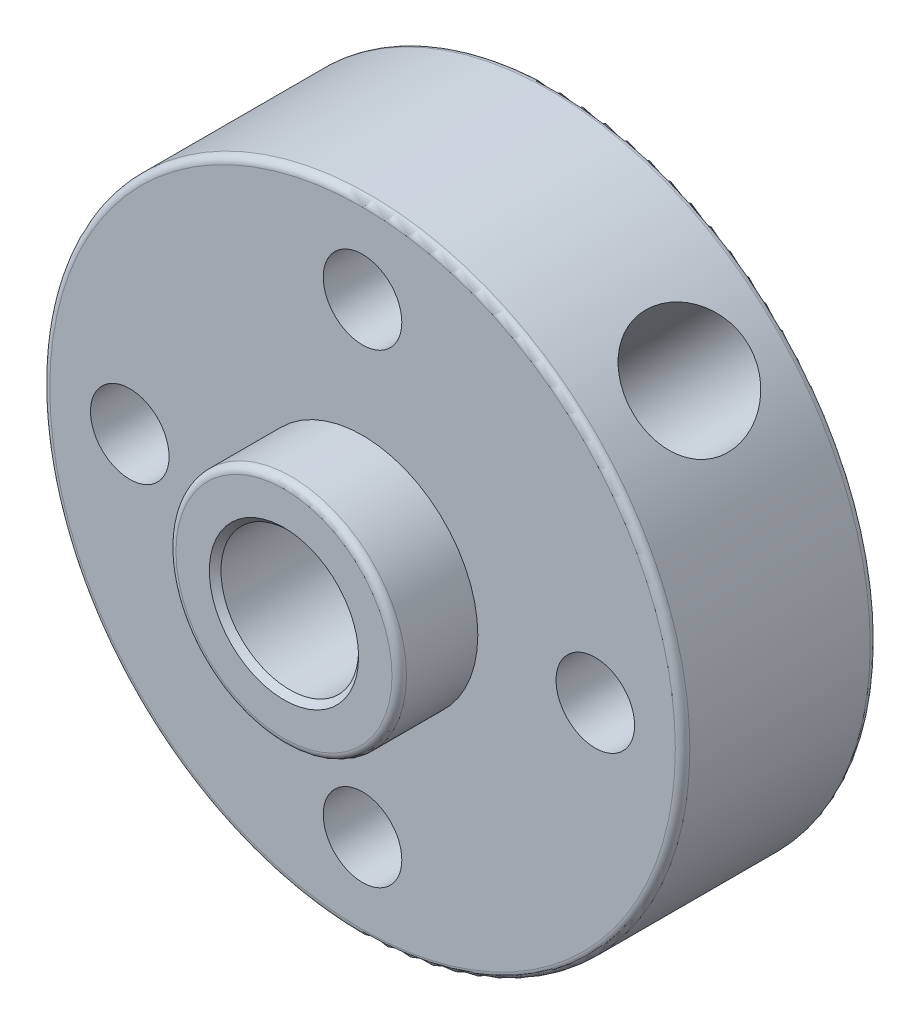
ISO-10303-21;
HEADER;
FILE_DESCRIPTION(('STEP AP214'),'2;1');
FILE_NAME('part.step','',(''),(''),'','','');
FILE_SCHEMA(('AUTOMOTIVE_DESIGN { 1 0 10303 214 1 1 1 1 }'));
ENDSEC;
DATA;
#1=APPLICATION_CONTEXT('core data for automotive mechanical design processes');
#2=APPLICATION_PROTOCOL_DEFINITION('international standard','automotive_design',2000,#1);
#3=PRODUCT_CONTEXT('',#1,'mechanical');
#4=PRODUCT('Part','Part','',(#3));
#5=PRODUCT_RELATED_PRODUCT_CATEGORY('part','',(#4));
#6=PRODUCT_DEFINITION_FORMATION('','',#4);
#7=PRODUCT_DEFINITION_CONTEXT('part definition',#1,'design');
#8=PRODUCT_DEFINITION('design','',#6,#7);
#9=PRODUCT_DEFINITION_SHAPE('','',#8);
#10=(LENGTH_UNIT() NAMED_UNIT(*) SI_UNIT(.MILLI.,.METRE.));
#11=(NAMED_UNIT(*) PLANE_ANGLE_UNIT() SI_UNIT($,.RADIAN.));
#12=(NAMED_UNIT(*) SI_UNIT($,.STERADIAN.) SOLID_ANGLE_UNIT());
#13=UNCERTAINTY_MEASURE_WITH_UNIT(LENGTH_MEASURE(1.E-05),#10,'distance_accuracy_value','');
#14=(GEOMETRIC_REPRESENTATION_CONTEXT(3) GLOBAL_UNCERTAINTY_ASSIGNED_CONTEXT((#13)) GLOBAL_UNIT_ASSIGNED_CONTEXT((#10,
#11,#12)) REPRESENTATION_CONTEXT('',''));
#15=CARTESIAN_POINT('',(0.,0.,0.));
#16=DIRECTION('',(0.,0.,1.));
#17=DIRECTION('',(1.,0.,0.));
#18=AXIS2_PLACEMENT_3D('',#15,#16,#17);
#19=CARTESIAN_POINT('',(0.,0.,0.));
#20=DIRECTION('',(0.,0.,1.));
#21=DIRECTION('',(1.,0.,0.));
#22=AXIS2_PLACEMENT_3D('',#19,#20,#21);
#23=PLANE('',#22);
#24=CARTESIAN_POINT('',(0.,0.,0.));
#25=DIRECTION('',(0.,0.,1.));
#26=DIRECTION('',(1.,0.,0.));
#27=AXIS2_PLACEMENT_3D('',#24,#25,#26);
#28=CIRCLE('',#27,10.75);
#29=CARTESIAN_POINT('',(10.75,0.,0.));
#30=VERTEX_POINT('',#29);
#31=EDGE_CURVE('E43',#30,#30,#28,.T.);
#32=ORIENTED_EDGE('',*,*,#31,.T.);
#33=EDGE_LOOP('',(#32));
#34=FACE_BOUND('',#33,.T.);
#35=CARTESIAN_POINT('',(-8.,0.,0.));
#36=DIRECTION('',(0.,0.,1.));
#37=DIRECTION('',(1.,0.,0.));
#38=AXIS2_PLACEMENT_3D('',#35,#36,#37);
#39=CIRCLE('',#38,1.35);
#40=CARTESIAN_POINT('',(-6.65,0.,0.));
#41=VERTEX_POINT('',#40);
#42=EDGE_CURVE('E99',#41,#41,#39,.T.);
#43=ORIENTED_EDGE('',*,*,#42,.F.);
#44=EDGE_LOOP('',(#43));
#45=FACE_BOUND('',#44,.T.);
#46=CARTESIAN_POINT('',(0.,-8.,0.));
#47=DIRECTION('',(0.,0.,1.));
#48=DIRECTION('',(1.,0.,0.));
#49=AXIS2_PLACEMENT_3D('',#46,#47,#48);
#50=CIRCLE('',#49,1.35);
#51=CARTESIAN_POINT('',(1.35,-8.,0.));
#52=VERTEX_POINT('',#51);
#53=EDGE_CURVE('E141',#52,#52,#50,.T.);
#54=ORIENTED_EDGE('',*,*,#53,.F.);
#55=EDGE_LOOP('',(#54));
#56=FACE_BOUND('',#55,.T.);
#57=CARTESIAN_POINT('',(8.,0.,0.));
#58=DIRECTION('',(0.,0.,1.));
#59=DIRECTION('',(1.,0.,0.));
#60=AXIS2_PLACEMENT_3D('',#57,#58,#59);
#61=CIRCLE('',#60,1.35);
#62=CARTESIAN_POINT('',(9.35,0.,0.));
#63=VERTEX_POINT('',#62);
#64=EDGE_CURVE('E145',#63,#63,#61,.T.);
#65=ORIENTED_EDGE('',*,*,#64,.F.);
#66=EDGE_LOOP('',(#65));
#67=FACE_BOUND('',#66,.T.);
#68=CARTESIAN_POINT('',(0.,8.,0.));
#69=DIRECTION('',(0.,0.,1.));
#70=DIRECTION('',(1.,0.,0.));
#71=AXIS2_PLACEMENT_3D('',#68,#69,#70);
#72=CIRCLE('',#71,1.35);
#73=CARTESIAN_POINT('',(1.35,8.,0.));
#74=VERTEX_POINT('',#73);
#75=EDGE_CURVE('E149',#74,#74,#72,.T.);
#76=ORIENTED_EDGE('',*,*,#75,.F.);
#77=EDGE_LOOP('',(#76));
#78=FACE_BOUND('',#77,.T.);
#79=CARTESIAN_POINT('',(0.,0.,0.));
#80=DIRECTION('',(0.,0.,1.));
#81=DIRECTION('',(1.,0.,0.));
#82=AXIS2_PLACEMENT_3D('',#79,#80,#81);
#83=CIRCLE('',#82,3.9625);
#84=CARTESIAN_POINT('',(3.9625,0.,0.));
#85=VERTEX_POINT('',#84);
#86=EDGE_CURVE('E70',#85,#85,#83,.T.);
#87=ORIENTED_EDGE('',*,*,#86,.F.);
#88=EDGE_LOOP('',(#87));
#89=FACE_BOUND('',#88,.T.);
#90=ADVANCED_FACE('F32',(#34,#45,#56,#67,#78,#89),#23,.T.);
#91=CARTESIAN_POINT('',(0.,0.,-6.7));
#92=DIRECTION('',(0.,0.,1.));
#93=DIRECTION('',(1.,0.,0.));
#94=AXIS2_PLACEMENT_3D('',#91,#92,#93);
#95=CYLINDRICAL_SURFACE('',#94,11.);
#96=CARTESIAN_POINT('',(0.,0.,-6.45));
#97=DIRECTION('',(0.,0.,1.));
#98=DIRECTION('',(1.,0.,0.));
#99=AXIS2_PLACEMENT_3D('',#96,#97,#98);
#100=CIRCLE('',#99,11.);
#101=CARTESIAN_POINT('',(11.,0.,-6.45));
#102=VERTEX_POINT('',#101);
#103=EDGE_CURVE('E52',#102,#102,#100,.T.);
#104=ORIENTED_EDGE('',*,*,#103,.T.);
#105=EDGE_LOOP('',(#104));
#106=FACE_BOUND('',#105,.T.);
#107=CARTESIAN_POINT('',(0.,0.,-0.25));
#108=DIRECTION('',(0.,0.,1.));
#109=DIRECTION('',(1.,0.,0.));
#110=AXIS2_PLACEMENT_3D('',#107,#108,#109);
#111=CIRCLE('',#110,11.);
#112=CARTESIAN_POINT('',(11.,0.,-0.25));
#113=VERTEX_POINT('',#112);
#114=EDGE_CURVE('E55',#113,#113,#111,.F.);
#115=ORIENTED_EDGE('',*,*,#114,.T.);
#116=EDGE_LOOP('',(#115));
#117=FACE_BOUND('',#116,.T.);
#118=CARTESIAN_POINT('',(9.06274283276228,6.23431570801607,-3.5));
#119=CARTESIAN_POINT('',(9.06274126869769,6.23432027104822,-3.61134012257296));
#120=CARTESIAN_POINT('',(9.05737501848907,6.2421410860834,-3.722737191288));
#121=CARTESIAN_POINT('',(9.03596195833592,6.27309590805742,-3.94239461587297));
#122=CARTESIAN_POINT('',(9.0199058641566,6.29624322611917,-4.05065215966928));
#123=CARTESIAN_POINT('',(8.97731780668885,6.35681727947307,-4.26082031301851));
#124=CARTESIAN_POINT('',(8.95079531574004,6.39423110220744,-4.36273656530805));
#125=CARTESIAN_POINT('',(8.88759547129021,6.48178591134148,-4.55752989162896));
#126=CARTESIAN_POINT('',(8.8509190090296,6.53192578071092,-4.65040775801638));
#127=CARTESIAN_POINT('',(8.76743111229011,6.64357190432209,-4.82558344744175));
#128=CARTESIAN_POINT('',(8.72051740433681,6.70519186738347,-4.90776007423395));
#129=CARTESIAN_POINT('',(8.61744976314321,6.83714524643469,-5.05814556283443));
#130=CARTESIAN_POINT('',(8.56129524088498,6.9074792177927,-5.12635353364538));
#131=CARTESIAN_POINT('',(8.44024267374072,7.05488837497966,-5.24732731845023));
#132=CARTESIAN_POINT('',(8.37528500080819,7.13200815228936,-5.2999792699958));
#133=CARTESIAN_POINT('',(8.23824410809116,7.28987281215714,-5.38761333302614));
#134=CARTESIAN_POINT('',(8.1661614396751,7.3706174139443,-5.42259681050937));
#135=CARTESIAN_POINT('',(8.0173986768152,7.53214687758186,-5.47352723325545));
#136=CARTESIAN_POINT('',(7.94077752664669,7.61292162894229,-5.48967831432072));
#137=CARTESIAN_POINT('',(7.78428207362666,7.77286728708989,-5.5031211674624));
#138=CARTESIAN_POINT('',(7.70440803245135,7.85203832212252,-5.50041445357154));
#139=CARTESIAN_POINT('',(7.5447119680256,8.00558888903868,-5.47637585792208));
#140=CARTESIAN_POINT('',(7.46490041504116,8.08001387686297,-5.45526374648556));
#141=CARTESIAN_POINT('',(7.30685962390046,8.22320989495296,-5.3953608025385));
#142=CARTESIAN_POINT('',(7.2286304409252,8.29198072830029,-5.35656935461377));
#143=CARTESIAN_POINT('',(7.07587117286445,8.42272040524733,-5.26219694022084));
#144=CARTESIAN_POINT('',(7.00136309052324,8.48465093392004,-5.20652735596616));
#145=CARTESIAN_POINT('',(6.85900743192368,8.60014139687727,-5.08004411007532));
#146=CARTESIAN_POINT('',(6.79116049490328,8.65370052809064,-5.00922899706451));
#147=CARTESIAN_POINT('',(6.663600803383,8.75231567621389,-4.85325154542072));
#148=CARTESIAN_POINT('',(6.60401950310794,8.79723789007789,-4.76789698208101));
#149=CARTESIAN_POINT('',(6.49644236590935,8.87697775947045,-4.58590593607908));
#150=CARTESIAN_POINT('',(6.44844667912576,8.91179528405184,-4.48926930723474));
#151=CARTESIAN_POINT('',(6.36592632904784,8.97092946506635,-4.28721748951318));
#152=CARTESIAN_POINT('',(6.33142227207191,8.99523006456892,-4.18178916836021));
#153=CARTESIAN_POINT('',(6.27749146387927,9.03295049879403,-3.96528255011163));
#154=CARTESIAN_POINT('',(6.25806311381759,9.04637148735387,-3.85420485348886));
#155=CARTESIAN_POINT('',(6.23532548196963,9.06205863132706,-3.63124019879459));
#156=CARTESIAN_POINT('',(6.23179147295654,9.06448030890648,-3.51938706733036));
#157=CARTESIAN_POINT('',(6.24038874930699,9.05856360041587,-3.29657544943893));
#158=CARTESIAN_POINT('',(6.25251930860637,9.05022571305954,-3.18561692178604));
#159=CARTESIAN_POINT('',(6.291746476018,9.02299746635386,-2.96861965594772));
#160=CARTESIAN_POINT('',(6.3187271351932,9.00418884914723,-2.86254961599197));
#161=CARTESIAN_POINT('',(6.38642505813139,8.95629855399786,-2.65734028117156));
#162=CARTESIAN_POINT('',(6.42714328121984,8.92721615860706,-2.55820147091432));
#163=CARTESIAN_POINT('',(6.52119009817111,8.85875198536768,-2.36848080398475));
#164=CARTESIAN_POINT('',(6.57465118168705,8.81926150313286,-2.27800388191562));
#165=CARTESIAN_POINT('',(6.69188011288224,8.73064298132519,-2.10926630840225));
#166=CARTESIAN_POINT('',(6.75564882951978,8.68151412913987,-2.03100668800034));
#167=CARTESIAN_POINT('',(6.89202382137046,8.57365993590079,-1.88792715385021));
#168=CARTESIAN_POINT('',(6.96473068693801,8.51482221722215,-1.8232876446382));
#169=CARTESIAN_POINT('',(7.11574154125479,8.38903242708492,-1.710553693917));
#170=CARTESIAN_POINT('',(7.19404532362183,8.32208065476285,-1.66245864272283));
#171=CARTESIAN_POINT('',(7.3531634716617,8.18181938889401,-1.58445196136356));
#172=CARTESIAN_POINT('',(7.43396322974906,8.10854356477782,-1.55445009512347));
#173=CARTESIAN_POINT('',(7.59579996375647,7.9571409319971,-1.51319265670284));
#174=CARTESIAN_POINT('',(7.67683691548015,7.87901460275862,-1.50193523486329));
#175=CARTESIAN_POINT('',(7.83549532828213,7.72122741121697,-1.49854747889448));
#176=CARTESIAN_POINT('',(7.91314916500872,7.64160483389191,-1.50614411151531));
#177=CARTESIAN_POINT('',(8.06412283225127,7.48211096368978,-1.53965294642394));
#178=CARTESIAN_POINT('',(8.1374426990873,7.40223967290293,-1.56556499519901));
#179=CARTESIAN_POINT('',(8.2778477126705,7.2448843005324,-1.63485690348927));
#180=CARTESIAN_POINT('',(8.34494244300898,7.16739667651385,-1.67820934537556));
#181=CARTESIAN_POINT('',(8.47163155171448,7.01720198137938,-1.78111940280876));
#182=CARTESIAN_POINT('',(8.53122546787589,6.94449520499447,-1.84067801627742));
#183=CARTESIAN_POINT('',(8.64261298632904,6.80538750341747,-1.97525763856189));
#184=CARTESIAN_POINT('',(8.69429031455873,6.73908505367216,-2.05047669538433));
#185=CARTESIAN_POINT('',(8.78808424494114,6.61631010218159,-2.21382951669353));
#186=CARTESIAN_POINT('',(8.83019860001533,6.55983991151637,-2.30196630856161));
#187=CARTESIAN_POINT('',(8.90460951689488,6.45847724372725,-2.48955967560111));
#188=CARTESIAN_POINT('',(8.93681836204213,6.41368871247949,-2.58910723931135));
#189=CARTESIAN_POINT('',(8.99049273880686,6.33823336445492,-2.79606327672598));
#190=CARTESIAN_POINT('',(9.01196858165549,6.30755299619202,-2.90346409160781));
#191=CARTESIAN_POINT('',(9.0395308104027,6.2679565387395,-3.09267668443226));
#192=CARTESIAN_POINT('',(9.04822878556571,6.25537055758518,-3.17336926260861));
#193=CARTESIAN_POINT('',(9.05983530203723,6.23854856384096,-3.33603095203218));
#194=CARTESIAN_POINT('',(9.06274398466731,6.23431234742618,-3.41800003206966));
#195=CARTESIAN_POINT('',(9.06274283276228,6.23431570801607,-3.5));
#196=B_SPLINE_CURVE_WITH_KNOTS('',3,(#118,#119,#120,#121,#122,#123,#124,#125,#126,#127,#128,
#129,#130,#131,#132,#133,#134,#135,#136,#137,#138,#139,#140,#141,#142,#143,#144,#145,#146,#147,
#148,#149,#150,#151,#152,#153,#154,#155,#156,#157,#158,#159,#160,#161,#162,#163,#164,#165,#166,
#167,#168,#169,#170,#171,#172,#173,#174,#175,#176,#177,#178,#179,#180,#181,#182,#183,#184,#185,
#186,#187,#188,#189,#190,#191,#192,#193,#194,#195),.UNSPECIFIED.,.T.,.F.,(4,2,2,2,2,2,2,2,2,2,2,
2,2,2,2,2,2,2,2,2,2,2,2,2,2,2,2,2,2,2,2,2,2,2,2,2,2,2,4),(0.,0.333720352628771,
0.667730923425361,1.00143989738151,1.33511959011685,1.6722993511526,2.00950061266478,
2.34911212511978,2.6886973772514,3.02456639415963,3.3604084455173,3.69229445292967,
4.02419201411038,4.35786328487979,4.69156654523441,5.03008350848145,5.36860485839155,
5.70764124486732,6.04664167012788,6.38083364646979,6.71501013332593,7.04661365662176,
7.37824034134339,7.71347820234125,8.04874433945132,8.38820522569594,8.72765360102077,
9.06539473675368,9.40310254298626,9.73594847886932,10.0687916249998,10.4011135484041,
10.7334559397116,11.0702887970716,11.4072007206838,11.7470154829573,12.0865031534681,
12.3322881015162,12.5780670496697),.UNSPECIFIED.);
#197=CARTESIAN_POINT('',(9.06274283276228,6.23431570801607,-3.5));
#198=VERTEX_POINT('',#197);
#199=EDGE_CURVE('E78',#198,#198,#196,.T.);
#200=ORIENTED_EDGE('',*,*,#199,.F.);
#201=EDGE_LOOP('',(#200));
#202=FACE_BOUND('',#201,.T.);
#203=ADVANCED_FACE('F102',(#106,#117,#202),#95,.T.);
#204=CARTESIAN_POINT('',(0.,0.,-6.7));
#205=DIRECTION('',(0.,0.,1.));
#206=DIRECTION('',(1.,0.,0.));
#207=AXIS2_PLACEMENT_3D('',#204,#205,#206);
#208=PLANE('',#207);
#209=CARTESIAN_POINT('',(0.,0.,-6.7));
#210=DIRECTION('',(0.,0.,1.));
#211=DIRECTION('',(1.,0.,0.));
#212=AXIS2_PLACEMENT_3D('',#209,#210,#211);
#213=CIRCLE('',#212,10.75);
#214=CARTESIAN_POINT('',(10.75,0.,-6.7));
#215=VERTEX_POINT('',#214);
#216=EDGE_CURVE('E47',#215,#215,#213,.F.);
#217=ORIENTED_EDGE('',*,*,#216,.T.);
#218=EDGE_LOOP('',(#217));
#219=FACE_BOUND('',#218,.T.);
#220=CARTESIAN_POINT('',(0.,0.,-6.7));
#221=DIRECTION('',(0.,0.,1.));
#222=DIRECTION('',(1.,0.,0.));
#223=AXIS2_PLACEMENT_3D('',#220,#221,#222);
#224=CIRCLE('',#223,2.565);
#225=CARTESIAN_POINT('',(2.565,0.,-6.7));
#226=VERTEX_POINT('',#225);
#227=EDGE_CURVE('E67',#226,#226,#224,.T.);
#228=ORIENTED_EDGE('',*,*,#227,.T.);
#229=EDGE_LOOP('',(#228));
#230=FACE_BOUND('',#229,.T.);
#231=CARTESIAN_POINT('',(-8.,0.,-6.7));
#232=DIRECTION('',(0.,0.,1.));
#233=DIRECTION('',(1.,0.,0.));
#234=AXIS2_PLACEMENT_3D('',#231,#232,#233);
#235=CIRCLE('',#234,1.35);
#236=CARTESIAN_POINT('',(-6.65,0.,-6.7));
#237=VERTEX_POINT('',#236);
#238=EDGE_CURVE('E100',#237,#237,#235,.T.);
#239=ORIENTED_EDGE('',*,*,#238,.T.);
#240=EDGE_LOOP('',(#239));
#241=FACE_BOUND('',#240,.T.);
#242=CARTESIAN_POINT('',(0.,-8.,-6.7));
#243=DIRECTION('',(0.,0.,1.));
#244=DIRECTION('',(1.,0.,0.));
#245=AXIS2_PLACEMENT_3D('',#242,#243,#244);
#246=CIRCLE('',#245,1.35);
#247=CARTESIAN_POINT('',(1.35,-8.,-6.7));
#248=VERTEX_POINT('',#247);
#249=EDGE_CURVE('E161',#248,#248,#246,.T.);
#250=ORIENTED_EDGE('',*,*,#249,.T.);
#251=EDGE_LOOP('',(#250));
#252=FACE_BOUND('',#251,.T.);
#253=CARTESIAN_POINT('',(8.,0.,-6.7));
#254=DIRECTION('',(0.,0.,1.));
#255=DIRECTION('',(1.,0.,0.));
#256=AXIS2_PLACEMENT_3D('',#253,#254,#255);
#257=CIRCLE('',#256,1.35);
#258=CARTESIAN_POINT('',(9.35,0.,-6.7));
#259=VERTEX_POINT('',#258);
#260=EDGE_CURVE('E158',#259,#259,#257,.T.);
#261=ORIENTED_EDGE('',*,*,#260,.T.);
#262=EDGE_LOOP('',(#261));
#263=FACE_BOUND('',#262,.T.);
#264=CARTESIAN_POINT('',(0.,8.,-6.7));
#265=DIRECTION('',(0.,0.,1.));
#266=DIRECTION('',(1.,0.,0.));
#267=AXIS2_PLACEMENT_3D('',#264,#265,#266);
#268=CIRCLE('',#267,1.35);
#269=CARTESIAN_POINT('',(1.35,8.,-6.7));
#270=VERTEX_POINT('',#269);
#271=EDGE_CURVE('E153',#270,#270,#268,.T.);
#272=ORIENTED_EDGE('',*,*,#271,.T.);
#273=EDGE_LOOP('',(#272));
#274=FACE_BOUND('',#273,.T.);
#275=ADVANCED_FACE('F107',(#219,#230,#241,#252,#263,#274),#208,.F.);
#276=CARTESIAN_POINT('',(0.,0.,2.7));
#277=DIRECTION('',(0.,0.,-1.));
#278=DIRECTION('',(-1.,0.,0.));
#279=AXIS2_PLACEMENT_3D('',#276,#277,#278);
#280=CYLINDRICAL_SURFACE('',#279,3.9625);
#281=CARTESIAN_POINT('',(0.,0.,2.45));
#282=DIRECTION('',(0.,0.,1.));
#283=DIRECTION('',(1.,0.,0.));
#284=AXIS2_PLACEMENT_3D('',#281,#282,#283);
#285=CIRCLE('',#284,3.9625);
#286=CARTESIAN_POINT('',(3.9625,0.,2.45));
#287=VERTEX_POINT('',#286);
#288=EDGE_CURVE('E10',#287,#287,#285,.F.);
#289=ORIENTED_EDGE('',*,*,#288,.T.);
#290=EDGE_LOOP('',(#289));
#291=FACE_BOUND('',#290,.T.);
#292=ORIENTED_EDGE('',*,*,#86,.T.);
#293=EDGE_LOOP('',(#292));
#294=FACE_BOUND('',#293,.T.);
#295=ADVANCED_FACE('F198',(#291,#294),#280,.T.);
#296=CARTESIAN_POINT('',(0.,0.,2.7));
#297=DIRECTION('',(0.,0.,1.));
#298=DIRECTION('',(1.,0.,0.));
#299=AXIS2_PLACEMENT_3D('',#296,#297,#298);
#300=PLANE('',#299);
#301=CARTESIAN_POINT('',(0.,0.,2.7));
#302=DIRECTION('',(0.,0.,1.));
#303=DIRECTION('',(1.,0.,0.));
#304=AXIS2_PLACEMENT_3D('',#301,#302,#303);
#305=CIRCLE('',#304,3.7125);
#306=CARTESIAN_POINT('',(3.7125,0.,2.7));
#307=VERTEX_POINT('',#306);
#308=EDGE_CURVE('E39',#307,#307,#305,.T.);
#309=ORIENTED_EDGE('',*,*,#308,.T.);
#310=EDGE_LOOP('',(#309));
#311=FACE_BOUND('',#310,.T.);
#312=CARTESIAN_POINT('',(0.,0.,2.7));
#313=DIRECTION('',(0.,0.,1.));
#314=DIRECTION('',(1.,0.,0.));
#315=AXIS2_PLACEMENT_3D('',#312,#313,#314);
#316=CIRCLE('',#315,2.565);
#317=CARTESIAN_POINT('',(2.565,0.,2.7));
#318=VERTEX_POINT('',#317);
#319=EDGE_CURVE('E58',#318,#318,#316,.F.);
#320=ORIENTED_EDGE('',*,*,#319,.T.);
#321=EDGE_LOOP('',(#320));
#322=FACE_BOUND('',#321,.T.);
#323=ADVANCED_FACE('F192',(#311,#322),#300,.T.);
#324=CARTESIAN_POINT('',(0.,0.,-6.7));
#325=DIRECTION('',(0.,0.,1.));
#326=DIRECTION('',(1.,0.,0.));
#327=AXIS2_PLACEMENT_3D('',#324,#325,#326);
#328=CYLINDRICAL_SURFACE('',#327,2.365);
#329=CARTESIAN_POINT('',(0.,0.,-6.5));
#330=DIRECTION('',(0.,0.,1.));
#331=DIRECTION('',(1.,0.,0.));
#332=AXIS2_PLACEMENT_3D('',#329,#330,#331);
#333=CIRCLE('',#332,2.365);
#334=CARTESIAN_POINT('',(2.365,0.,-6.5));
#335=VERTEX_POINT('',#334);
#336=EDGE_CURVE('E61',#335,#335,#333,.F.);
#337=ORIENTED_EDGE('',*,*,#336,.T.);
#338=EDGE_LOOP('',(#337));
#339=FACE_BOUND('',#338,.T.);
#340=CARTESIAN_POINT('',(0.,0.,2.5));
#341=DIRECTION('',(0.,0.,1.));
#342=DIRECTION('',(1.,0.,0.));
#343=AXIS2_PLACEMENT_3D('',#340,#341,#342);
#344=CIRCLE('',#343,2.365);
#345=CARTESIAN_POINT('',(2.365,0.,2.5));
#346=VERTEX_POINT('',#345);
#347=EDGE_CURVE('E64',#346,#346,#344,.T.);
#348=ORIENTED_EDGE('',*,*,#347,.T.);
#349=EDGE_LOOP('',(#348));
#350=FACE_BOUND('',#349,.T.);
#351=CARTESIAN_POINT('',(2.365,0.,-4.59699020050318));
#352=CARTESIAN_POINT('',(2.3649952662666,0.0915545623279406,-4.69570078330176));
#353=CARTESIAN_POINT('',(2.35964104770869,0.189751393033493,-4.78838746022972));
#354=CARTESIAN_POINT('',(2.33404220790086,0.395259337163322,-4.96104975161479));
#355=CARTESIAN_POINT('',(2.31378338633933,0.502579056087071,-5.04101315558752));
#356=CARTESIAN_POINT('',(2.26108959391348,0.699095464161241,-5.17013106567404));
#357=CARTESIAN_POINT('',(2.23216193800811,0.787290430576468,-5.2222208358685));
#358=CARTESIAN_POINT('',(2.16145820190548,0.964566352940445,-5.31480380424675));
#359=CARTESIAN_POINT('',(2.1197057161783,1.05364539357385,-5.35531803648713));
#360=CARTESIAN_POINT('',(2.02999999464893,1.21639233039962,-5.41743450537339));
#361=CARTESIAN_POINT('',(1.98393338294683,1.29035724860562,-5.44096808888181));
#362=CARTESIAN_POINT('',(1.88235984649219,1.43446874195004,-5.4767514371793));
#363=CARTESIAN_POINT('',(1.82685709074714,1.50461698535408,-5.48900616983765));
#364=CARTESIAN_POINT('',(1.70743715689725,1.63889446111059,-5.50143797153775));
#365=CARTESIAN_POINT('',(1.64349811654337,1.703007286826,-5.50158301779722));
#366=CARTESIAN_POINT('',(1.50932980477726,1.82297854691415,-5.48970456732576));
#367=CARTESIAN_POINT('',(1.43909989385107,1.87883614054797,-5.4776798321632));
#368=CARTESIAN_POINT('',(1.29760551808412,1.97905896371153,-5.44296784312812));
#369=CARTESIAN_POINT('',(1.22648907244522,2.02378836717323,-5.42071623264386));
#370=CARTESIAN_POINT('',(1.08272713017306,2.10421605887351,-5.36689577358813));
#371=CARTESIAN_POINT('',(1.01008093027715,2.13991009063214,-5.33532254880651));
#372=CARTESIAN_POINT('',(0.837822160239394,2.21428588369568,-5.25078665952653));
#373=CARTESIAN_POINT('',(0.738290615828771,2.24908799729391,-5.19424108771547));
#374=CARTESIAN_POINT('',(0.543012485412962,2.30406063740925,-5.06881170989739));
#375=CARTESIAN_POINT('',(0.44727305845101,2.32420463013842,-4.9999058090638));
#376=CARTESIAN_POINT('',(0.260772979138693,2.3525007311514,-4.85051081099977));
#377=CARTESIAN_POINT('',(0.170122686955384,2.36044616158111,-4.76984690893213));
#378=CARTESIAN_POINT('',(-0.00168445422746592,2.36655379407312,-4.59864575515446));
#379=CARTESIAN_POINT('',(-0.0828440288336493,2.36471881202481,-4.50811135262362));
#380=CARTESIAN_POINT('',(-0.212259785699663,2.35610498526489,-4.34148666295089));
#381=CARTESIAN_POINT('',(-0.263597550329155,2.35072718830942,-4.26771471035828));
#382=CARTESIAN_POINT('',(-0.355806320269099,2.33854129276598,-4.11395058386401));
#383=CARTESIAN_POINT('',(-0.396695139109953,2.33173566493839,-4.03396930345003));
#384=CARTESIAN_POINT('',(-0.45460332663403,2.32103360726821,-3.88968277945848));
#385=CARTESIAN_POINT('',(-0.475074419135497,2.31684346702378,-3.82681315914041));
#386=CARTESIAN_POINT('',(-0.505544944374447,2.31038957467289,-3.69853985873845));
#387=CARTESIAN_POINT('',(-0.515570051494705,2.30812110202897,-3.63314280331791));
#388=CARTESIAN_POINT('',(-0.523675922323147,2.30629845903047,-3.50114446284039));
#389=CARTESIAN_POINT('',(-0.521685458617752,2.30676047446774,-3.43453833478724));
#390=CARTESIAN_POINT('',(-0.505934192612257,2.31026213974396,-3.30277000908513));
#391=CARTESIAN_POINT('',(-0.492153551172444,2.3133061341627,-3.23761043523813));
#392=CARTESIAN_POINT('',(-0.448906898116118,2.32213708396794,-3.09028643966475));
#393=CARTESIAN_POINT('',(-0.415865763659071,2.32848622198117,-3.00923650172896));
#394=CARTESIAN_POINT('',(-0.337770484184663,2.34108895817828,-2.85305123474711));
#395=CARTESIAN_POINT('',(-0.29267285393147,2.34734212211568,-2.77793861689183));
#396=CARTESIAN_POINT('',(-0.203994487237467,2.35651984083085,-2.64805159775745));
#397=CARTESIAN_POINT('',(-0.16195247252815,2.35986185858191,-2.59223675434713));
#398=CARTESIAN_POINT('',(-0.0735799870507835,2.36427028129515,-2.48400038738772));
#399=CARTESIAN_POINT('',(-0.0272471235247539,2.36533540849774,-2.43158078519215));
#400=CARTESIAN_POINT('',(0.116901359472331,2.36405472125976,-2.27927253745716));
#401=CARTESIAN_POINT('',(0.219948817342805,2.3572438844172,-2.184220247256));
#402=CARTESIAN_POINT('',(0.420244909396986,2.32925415101914,-2.02042438907659));
#403=CARTESIAN_POINT('',(0.516311617796022,2.31020185807645,-1.94986040036324));
#404=CARTESIAN_POINT('',(0.712581656730469,2.25737096690486,-1.82111349265634));
#405=CARTESIAN_POINT('',(0.812776524907069,2.22362125796694,-1.762906616658));
#406=CARTESIAN_POINT('',(0.993112205079467,2.14812535663656,-1.67216278436016));
#407=CARTESIAN_POINT('',(1.07312144889032,2.10946980336528,-1.63680704680867));
#408=CARTESIAN_POINT('',(1.23131768145842,2.02120330393184,-1.57737273119859));
#409=CARTESIAN_POINT('',(1.30950572658052,1.97159889276966,-1.55328745283007));
#410=CARTESIAN_POINT('',(1.46177707970368,1.86153191734422,-1.51781453166245));
#411=CARTESIAN_POINT('',(1.53583348303157,1.80100708823931,-1.50650255293032));
#412=CARTESIAN_POINT('',(1.67643778330524,1.67091072748538,-1.49771318843313));
#413=CARTESIAN_POINT('',(1.74298814025637,1.60134217597889,-1.50023125653248));
#414=CARTESIAN_POINT('',(1.86042779769337,1.46270291871952,-1.5179828364679));
#415=CARTESIAN_POINT('',(1.91220526094794,1.39421694116579,-1.531981340472));
#416=CARTESIAN_POINT('',(2.00689571822627,1.25409337247092,-1.57025705261886));
#417=CARTESIAN_POINT('',(2.04980665365647,1.18245505410492,-1.59453664380057));
#418=CARTESIAN_POINT('',(2.12858200121258,1.03429635526296,-1.65366258729709));
#419=CARTESIAN_POINT('',(2.16396462130812,0.957715670860504,-1.68899229899958));
#420=CARTESIAN_POINT('',(2.2252102122747,0.80524895888115,-1.76819667189091));
#421=CARTESIAN_POINT('',(2.25107124562982,0.729363075747095,-1.81207306944202));
#422=CARTESIAN_POINT('',(2.304544474528,0.543691002562276,-1.93001318487587));
#423=CARTESIAN_POINT('',(2.32699963068956,0.435183058560517,-2.00843732569527));
#424=CARTESIAN_POINT('',(2.35651127288474,0.226349778317022,-2.17876212693779));
#425=CARTESIAN_POINT('',(2.36349654169699,0.126064324087384,-2.27072304484978));
#426=CARTESIAN_POINT('',(2.36543513283428,-0.0156255360860658,-2.41882533506974));
#427=CARTESIAN_POINT('',(2.36460607442918,-0.0618097339579139,-2.47044758805531));
#428=CARTESIAN_POINT('',(2.36064426586175,-0.150108228913164,-2.57707076511096));
#429=CARTESIAN_POINT('',(2.35751005352878,-0.192219923595369,-2.63207381333354));
#430=CARTESIAN_POINT('',(2.34975028617581,-0.271029630894712,-2.74530058769362));
#431=CARTESIAN_POINT('',(2.34513319987462,-0.307756700726604,-2.80350450559961));
#432=CARTESIAN_POINT('',(2.33540829727704,-0.374468563716528,-2.9235593793461));
#433=CARTESIAN_POINT('',(2.33030132939039,-0.404464723388215,-2.98540396074638));
#434=CARTESIAN_POINT('',(2.32106839918196,-0.454407005445905,-3.10981452004366));
#435=CARTESIAN_POINT('',(2.31690766736767,-0.474758403469716,-3.17221071272526));
#436=CARTESIAN_POINT('',(2.31047495482788,-0.505154863465118,-3.2994745008761));
#437=CARTESIAN_POINT('',(2.30819761435011,-0.515229191146792,-3.36433452995346));
#438=CARTESIAN_POINT('',(2.30630815128594,-0.523633942622959,-3.4952728223363));
#439=CARTESIAN_POINT('',(2.30671165732278,-0.521895499763577,-3.5613559856556));
#440=CARTESIAN_POINT('',(2.31007133318499,-0.506800168696246,-3.6921897439609));
#441=CARTESIAN_POINT('',(2.31303329826635,-0.493416902883391,-3.75693697171212));
#442=CARTESIAN_POINT('',(2.32169818459388,-0.451142103429726,-3.90349989486578));
#443=CARTESIAN_POINT('',(2.32797228587485,-0.418679793119965,-3.984221525721));
#444=CARTESIAN_POINT('',(2.34048927796869,-0.341824378441557,-4.13968489945155));
#445=CARTESIAN_POINT('',(2.34673208581777,-0.297408505656323,-4.2144148735127));
#446=CARTESIAN_POINT('',(2.35581401609364,-0.211596938656995,-4.34128768412437));
#447=CARTESIAN_POINT('',(2.35910845015847,-0.17195220416844,-4.39460602587775));
#448=CARTESIAN_POINT('',(2.36370197233796,-0.0887424687039047,-4.49810063059606));
#449=CARTESIAN_POINT('',(2.36500233598452,-0.0451799926575581,-4.54827888243594));
#450=CARTESIAN_POINT('',(2.365,0.,-4.59699020050318));
#451=B_SPLINE_CURVE_WITH_KNOTS('',3,(#351,#352,#353,#354,#355,#356,#357,#358,#359,#360,#361,
#362,#363,#364,#365,#366,#367,#368,#369,#370,#371,#372,#373,#374,#375,#376,#377,#378,#379,#380,
#381,#382,#383,#384,#385,#386,#387,#388,#389,#390,#391,#392,#393,#394,#395,#396,#397,#398,#399,
#400,#401,#402,#403,#404,#405,#406,#407,#408,#409,#410,#411,#412,#413,#414,#415,#416,#417,#418,
#419,#420,#421,#422,#423,#424,#425,#426,#427,#428,#429,#430,#431,#432,#433,#434,#435,#436,#437,
#438,#439,#440,#441,#442,#443,#444,#445,#446,#447,#448,#449,#450),.UNSPECIFIED.,.T.,.F.,(4,2,2,
2,2,2,2,2,2,2,2,2,2,2,2,2,2,2,2,2,2,2,2,2,2,2,2,2,2,2,2,2,2,2,2,2,2,2,2,2,2,2,2,2,2,2,2,2,2,4),
(0.,0.403695978561856,0.807777076044562,1.1258923873766,1.44342591658597,1.71304037690946,
1.98253602625535,2.25274430577274,2.52298008521982,2.78264136919192,3.042424750491,
3.39941443543289,3.75704873802853,4.12067799301079,4.48420256074714,4.75372878330292,
5.02279240081331,5.22082604366994,5.41837179847995,5.61708973530268,5.81614271068387,
6.07794330599674,6.34070120682181,6.55030387926051,6.76002414698416,7.17904644212166,
7.53988001283783,7.90000750675571,8.18576536072952,8.47135311459195,8.758623847654,
9.04580015634139,9.305600799356,9.56546169419333,9.83882048786998,10.1122348757129,
10.517351937542,10.9243301543609,11.131957413949,11.3397164862487,11.5463095339184,
11.7525510367144,11.9491224138022,12.1451324444714,12.3422861601535,12.5398876302873,
12.8001154536119,13.0608424947077,13.2601843955573,13.459398731616),.UNSPECIFIED.);
#452=CARTESIAN_POINT('',(2.365,0.,-4.59699020050318));
#453=VERTEX_POINT('',#452);
#454=EDGE_CURVE('E71',#453,#453,#451,.T.);
#455=ORIENTED_EDGE('',*,*,#454,.T.);
#456=EDGE_LOOP('',(#455));
#457=FACE_BOUND('',#456,.T.);
#458=ADVANCED_FACE('F80',(#339,#350,#457),#328,.F.);
#459=CARTESIAN_POINT('',(0.,8.,-6.7));
#460=DIRECTION('',(0.,0.,1.));
#461=DIRECTION('',(1.,0.,0.));
#462=AXIS2_PLACEMENT_3D('',#459,#460,#461);
#463=CYLINDRICAL_SURFACE('',#462,1.35);
#464=ORIENTED_EDGE('',*,*,#271,.F.);
#465=EDGE_LOOP('',(#464));
#466=FACE_BOUND('',#465,.T.);
#467=ORIENTED_EDGE('',*,*,#75,.T.);
#468=EDGE_LOOP('',(#467));
#469=FACE_BOUND('',#468,.T.);
#470=ADVANCED_FACE('F182',(#466,#469),#463,.F.);
#471=CARTESIAN_POINT('',(8.,0.,-6.7));
#472=DIRECTION('',(0.,0.,1.));
#473=DIRECTION('',(1.,0.,0.));
#474=AXIS2_PLACEMENT_3D('',#471,#472,#473);
#475=CYLINDRICAL_SURFACE('',#474,1.35);
#476=ORIENTED_EDGE('',*,*,#260,.F.);
#477=EDGE_LOOP('',(#476));
#478=FACE_BOUND('',#477,.T.);
#479=ORIENTED_EDGE('',*,*,#64,.T.);
#480=EDGE_LOOP('',(#479));
#481=FACE_BOUND('',#480,.T.);
#482=ADVANCED_FACE('F177',(#478,#481),#475,.F.);
#483=CARTESIAN_POINT('',(0.,-8.,-6.7));
#484=DIRECTION('',(0.,0.,1.));
#485=DIRECTION('',(1.,0.,0.));
#486=AXIS2_PLACEMENT_3D('',#483,#484,#485);
#487=CYLINDRICAL_SURFACE('',#486,1.35);
#488=ORIENTED_EDGE('',*,*,#249,.F.);
#489=EDGE_LOOP('',(#488));
#490=FACE_BOUND('',#489,.T.);
#491=ORIENTED_EDGE('',*,*,#53,.T.);
#492=EDGE_LOOP('',(#491));
#493=FACE_BOUND('',#492,.T.);
#494=ADVANCED_FACE('F173',(#490,#493),#487,.F.);
#495=CARTESIAN_POINT('',(-8.,0.,-6.7));
#496=DIRECTION('',(0.,0.,1.));
#497=DIRECTION('',(1.,0.,0.));
#498=AXIS2_PLACEMENT_3D('',#495,#496,#497);
#499=CYLINDRICAL_SURFACE('',#498,1.35);
#500=ORIENTED_EDGE('',*,*,#238,.F.);
#501=EDGE_LOOP('',(#500));
#502=FACE_BOUND('',#501,.T.);
#503=ORIENTED_EDGE('',*,*,#42,.T.);
#504=EDGE_LOOP('',(#503));
#505=FACE_BOUND('',#504,.T.);
#506=ADVANCED_FACE('F89',(#502,#505),#499,.F.);
#507=CARTESIAN_POINT('',(11.,11.,-3.5));
#508=DIRECTION('',(-0.707106781186549,-0.707106781186546,0.));
#509=DIRECTION('',(0.707106781186546,-0.707106781186549,0.));
#510=AXIS2_PLACEMENT_3D('',#507,#508,#509);
#511=CYLINDRICAL_SURFACE('',#510,2.);
#512=ORIENTED_EDGE('',*,*,#199,.T.);
#513=EDGE_LOOP('',(#512));
#514=FACE_BOUND('',#513,.T.);
#515=ORIENTED_EDGE('',*,*,#454,.F.);
#516=EDGE_LOOP('',(#515));
#517=FACE_BOUND('',#516,.T.);
#518=ADVANCED_FACE('F84',(#514,#517),#511,.F.);
#519=CARTESIAN_POINT('',(0.,0.,-6.7));
#520=DIRECTION('',(0.,0.,-1.));
#521=DIRECTION('',(-1.,0.,0.));
#522=AXIS2_PLACEMENT_3D('',#519,#520,#521);
#523=CONICAL_SURFACE('',#522,2.565,0.785398163397445);
#524=ORIENTED_EDGE('',*,*,#336,.F.);
#525=EDGE_LOOP('',(#524));
#526=FACE_BOUND('',#525,.T.);
#527=ORIENTED_EDGE('',*,*,#227,.F.);
#528=EDGE_LOOP('',(#527));
#529=FACE_BOUND('',#528,.T.);
#530=ADVANCED_FACE('F88',(#526,#529),#523,.F.);
#531=CARTESIAN_POINT('',(0.,0.,2.5));
#532=DIRECTION('',(0.,0.,1.));
#533=DIRECTION('',(1.,0.,0.));
#534=AXIS2_PLACEMENT_3D('',#531,#532,#533);
#535=CONICAL_SURFACE('',#534,2.365,0.785398163397458);
#536=ORIENTED_EDGE('',*,*,#319,.F.);
#537=EDGE_LOOP('',(#536));
#538=FACE_BOUND('',#537,.T.);
#539=ORIENTED_EDGE('',*,*,#347,.F.);
#540=EDGE_LOOP('',(#539));
#541=FACE_BOUND('',#540,.T.);
#542=ADVANCED_FACE('F112',(#538,#541),#535,.F.);
#543=CARTESIAN_POINT('',(0.,0.,-6.45));
#544=DIRECTION('',(0.,0.,1.));
#545=DIRECTION('',(1.,0.,0.));
#546=AXIS2_PLACEMENT_3D('',#543,#544,#545);
#547=TOROIDAL_SURFACE('',#546,10.75,0.25);
#548=ORIENTED_EDGE('',*,*,#216,.F.);
#549=EDGE_LOOP('',(#548));
#550=FACE_BOUND('',#549,.T.);
#551=ORIENTED_EDGE('',*,*,#103,.F.);
#552=EDGE_LOOP('',(#551));
#553=FACE_BOUND('',#552,.T.);
#554=ADVANCED_FACE('F116',(#550,#553),#547,.T.);
#555=CARTESIAN_POINT('',(0.,0.,-0.25));
#556=DIRECTION('',(0.,0.,1.));
#557=DIRECTION('',(1.,0.,0.));
#558=AXIS2_PLACEMENT_3D('',#555,#556,#557);
#559=TOROIDAL_SURFACE('',#558,10.75,0.25);
#560=ORIENTED_EDGE('',*,*,#114,.F.);
#561=EDGE_LOOP('',(#560));
#562=FACE_BOUND('',#561,.T.);
#563=ORIENTED_EDGE('',*,*,#31,.F.);
#564=EDGE_LOOP('',(#563));
#565=FACE_BOUND('',#564,.T.);
#566=ADVANCED_FACE('F119',(#562,#565),#559,.T.);
#567=CARTESIAN_POINT('',(0.,0.,2.45));
#568=DIRECTION('',(0.,0.,1.));
#569=DIRECTION('',(1.,0.,0.));
#570=AXIS2_PLACEMENT_3D('',#567,#568,#569);
#571=TOROIDAL_SURFACE('',#570,3.7125,0.25);
#572=ORIENTED_EDGE('',*,*,#288,.F.);
#573=EDGE_LOOP('',(#572));
#574=FACE_BOUND('',#573,.T.);
#575=ORIENTED_EDGE('',*,*,#308,.F.);
#576=EDGE_LOOP('',(#575));
#577=FACE_BOUND('',#576,.T.);
#578=ADVANCED_FACE('F34',(#574,#577),#571,.T.);
#579=CLOSED_SHELL('',(#90,#203,#275,#295,#323,#458,#470,#482,#494,#506,#518,#530,#542,#554,#566,#578));
#580=MANIFOLD_SOLID_BREP('B2',#579);
#581=ADVANCED_BREP_SHAPE_REPRESENTATION('',(#18,#580),#14);
#582=SHAPE_DEFINITION_REPRESENTATION(#9,#581);
ENDSEC;
END-ISO-10303-21;
